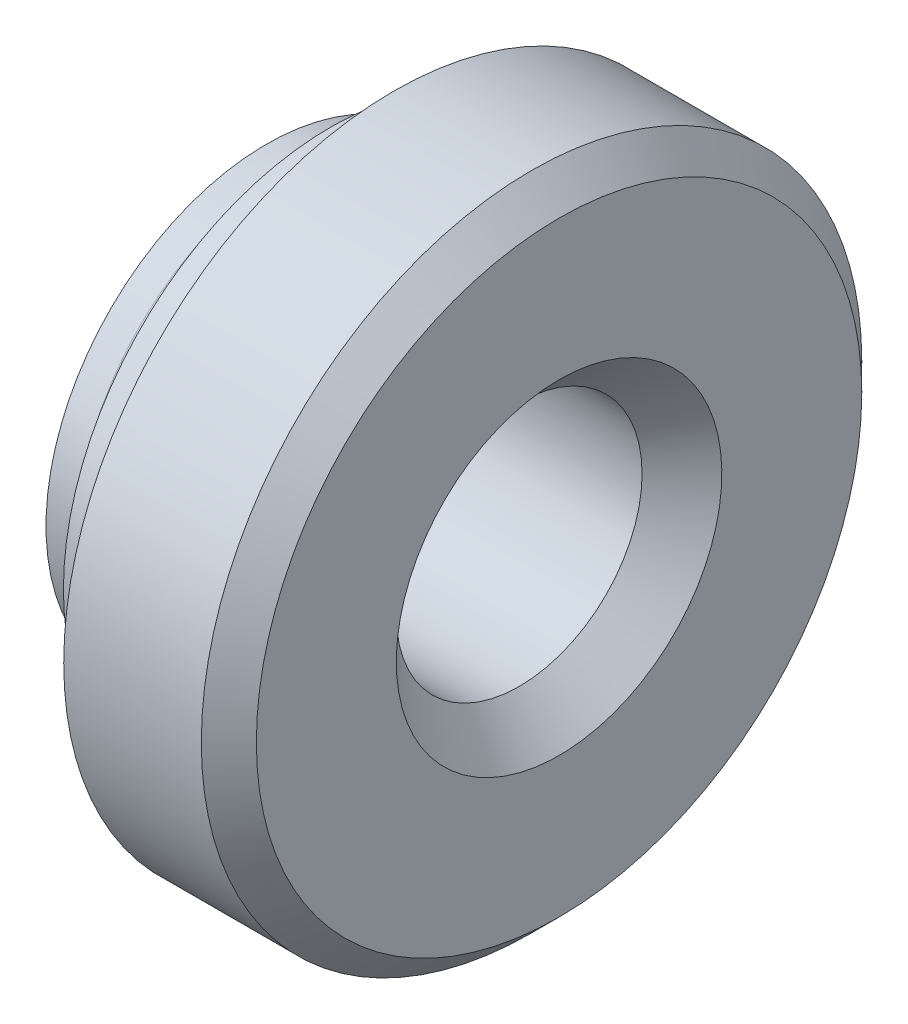
ISO-10303-21;
HEADER;
FILE_DESCRIPTION(('STEP AP214'),'2;1');
FILE_NAME('part.step','',(''),(''),'','','');
FILE_SCHEMA(('AUTOMOTIVE_DESIGN { 1 0 10303 214 1 1 1 1 }'));
ENDSEC;
DATA;
#1=APPLICATION_CONTEXT('core data for automotive mechanical design processes');
#2=APPLICATION_PROTOCOL_DEFINITION('international standard','automotive_design',2000,#1);
#3=PRODUCT_CONTEXT('',#1,'mechanical');
#4=PRODUCT('Part','Part','',(#3));
#5=PRODUCT_RELATED_PRODUCT_CATEGORY('part','',(#4));
#6=PRODUCT_DEFINITION_FORMATION('','',#4);
#7=PRODUCT_DEFINITION_CONTEXT('part definition',#1,'design');
#8=PRODUCT_DEFINITION('design','',#6,#7);
#9=PRODUCT_DEFINITION_SHAPE('','',#8);
#10=(LENGTH_UNIT() NAMED_UNIT(*) SI_UNIT(.MILLI.,.METRE.));
#11=(NAMED_UNIT(*) PLANE_ANGLE_UNIT() SI_UNIT($,.RADIAN.));
#12=(NAMED_UNIT(*) SI_UNIT($,.STERADIAN.) SOLID_ANGLE_UNIT());
#13=UNCERTAINTY_MEASURE_WITH_UNIT(LENGTH_MEASURE(1.E-05),#10,'distance_accuracy_value','');
#14=(GEOMETRIC_REPRESENTATION_CONTEXT(3) GLOBAL_UNCERTAINTY_ASSIGNED_CONTEXT((#13)) GLOBAL_UNIT_ASSIGNED_CONTEXT((#10,
#11,#12)) REPRESENTATION_CONTEXT('',''));
#15=CARTESIAN_POINT('',(0.,0.,0.));
#16=DIRECTION('',(0.,0.,1.));
#17=DIRECTION('',(1.,0.,0.));
#18=AXIS2_PLACEMENT_3D('',#15,#16,#17);
#19=CARTESIAN_POINT('',(0.316523077003695,0.,0.));
#20=DIRECTION('',(-1.,0.,0.));
#21=DIRECTION('',(0.,0.,1.));
#22=AXIS2_PLACEMENT_3D('',#19,#20,#21);
#23=CONICAL_SURFACE('',#22,2.37489999999951,0.106779263745891);
#24=CARTESIAN_POINT('',(0.316523076923077,0.,0.));
#25=DIRECTION('',(1.,0.,0.));
#26=DIRECTION('',(0.,0.,-1.));
#27=AXIS2_PLACEMENT_3D('',#24,#25,#26);
#28=CIRCLE('',#27,2.3749);
#29=CARTESIAN_POINT('',(0.316523076923077,0.,-2.3749));
#30=VERTEX_POINT('',#29);
#31=EDGE_CURVE('E31',#30,#30,#28,.F.);
#32=ORIENTED_EDGE('',*,*,#31,.F.);
#33=EDGE_LOOP('',(#32));
#34=FACE_BOUND('',#33,.T.);
#35=CARTESIAN_POINT('',(0.685799999985192,0.,0.));
#36=DIRECTION('',(-1.,0.,0.));
#37=DIRECTION('',(0.,0.,1.));
#38=AXIS2_PLACEMENT_3D('',#35,#36,#37);
#39=CIRCLE('',#38,2.33531833334309);
#40=CARTESIAN_POINT('',(0.685799999985192,0.,2.33531833334309));
#41=VERTEX_POINT('',#40);
#42=EDGE_CURVE('E19',#41,#41,#39,.F.);
#43=ORIENTED_EDGE('',*,*,#42,.F.);
#44=EDGE_LOOP('',(#43));
#45=FACE_BOUND('',#44,.T.);
#46=ADVANCED_FACE('F15',(#34,#45),#23,.T.);
#47=CARTESIAN_POINT('',(0.158261538461538,0.,0.));
#48=DIRECTION('',(1.,0.,0.));
#49=DIRECTION('',(0.,0.,-1.));
#50=AXIS2_PLACEMENT_3D('',#47,#48,#49);
#51=CYLINDRICAL_SURFACE('',#50,2.3749);
#52=ORIENTED_EDGE('',*,*,#31,.T.);
#53=EDGE_LOOP('',(#52));
#54=FACE_BOUND('',#53,.T.);
#55=CARTESIAN_POINT('',(0.,0.,0.));
#56=DIRECTION('',(1.,0.,0.));
#57=DIRECTION('',(0.,0.,-1.));
#58=AXIS2_PLACEMENT_3D('',#55,#56,#57);
#59=CIRCLE('',#58,2.3749);
#60=CARTESIAN_POINT('',(0.,0.,-2.3749));
#61=VERTEX_POINT('',#60);
#62=EDGE_CURVE('E47',#61,#61,#59,.F.);
#63=ORIENTED_EDGE('',*,*,#62,.F.);
#64=EDGE_LOOP('',(#63));
#65=FACE_BOUND('',#64,.T.);
#66=ADVANCED_FACE('F57',(#54,#65),#51,.T.);
#67=CARTESIAN_POINT('',(0.6858,0.,0.));
#68=DIRECTION('',(-1.,0.,0.));
#69=DIRECTION('',(0.,0.,1.));
#70=AXIS2_PLACEMENT_3D('',#67,#68,#69);
#71=PLANE('',#70);
#72=CARTESIAN_POINT('',(0.6858,0.,0.));
#73=DIRECTION('',(-1.,0.,0.));
#74=DIRECTION('',(0.,0.,1.));
#75=AXIS2_PLACEMENT_3D('',#72,#73,#74);
#76=CIRCLE('',#75,2.873629);
#77=CARTESIAN_POINT('',(0.685799999999999,0.,2.873629));
#78=VERTEX_POINT('',#77);
#79=EDGE_CURVE('E45',#78,#78,#76,.F.);
#80=ORIENTED_EDGE('',*,*,#79,.F.);
#81=EDGE_LOOP('',(#80));
#82=FACE_BOUND('',#81,.T.);
#83=ORIENTED_EDGE('',*,*,#42,.T.);
#84=EDGE_LOOP('',(#83));
#85=FACE_BOUND('',#84,.T.);
#86=ADVANCED_FACE('F68',(#82,#85),#71,.T.);
#87=CARTESIAN_POINT('',(0.,0.,1.18745));
#88=DIRECTION('',(-1.,0.,0.));
#89=DIRECTION('',(0.,0.,1.));
#90=AXIS2_PLACEMENT_3D('',#87,#88,#89);
#91=PLANE('',#90);
#92=ORIENTED_EDGE('',*,*,#62,.T.);
#93=EDGE_LOOP('',(#92));
#94=FACE_BOUND('',#93,.T.);
#95=CARTESIAN_POINT('',(0.,0.,0.));
#96=DIRECTION('',(-1.,0.,0.));
#97=DIRECTION('',(0.,-1.,0.));
#98=AXIS2_PLACEMENT_3D('',#95,#96,#97);
#99=CIRCLE('',#98,1.75260000003163);
#100=CARTESIAN_POINT('',(0.,-1.75260000003163,0.));
#101=VERTEX_POINT('',#100);
#102=EDGE_CURVE('E42',#101,#101,#99,.T.);
#103=ORIENTED_EDGE('',*,*,#102,.F.);
#104=EDGE_LOOP('',(#103));
#105=FACE_BOUND('',#104,.T.);
#106=ADVANCED_FACE('F108',(#94,#105),#91,.T.);
#107=CARTESIAN_POINT('',(1.0287,0.,0.));
#108=DIRECTION('',(-1.,0.,0.));
#109=DIRECTION('',(0.,0.,1.));
#110=AXIS2_PLACEMENT_3D('',#107,#108,#109);
#111=CYLINDRICAL_SURFACE('',#110,2.873629);
#112=CARTESIAN_POINT('',(1.3716,0.,0.));
#113=DIRECTION('',(-1.,0.,0.));
#114=DIRECTION('',(0.,0.,1.));
#115=AXIS2_PLACEMENT_3D('',#112,#113,#114);
#116=CIRCLE('',#115,2.873629);
#117=CARTESIAN_POINT('',(1.3716,0.,2.873629));
#118=VERTEX_POINT('',#117);
#119=EDGE_CURVE('E39',#118,#118,#116,.F.);
#120=ORIENTED_EDGE('',*,*,#119,.F.);
#121=EDGE_LOOP('',(#120));
#122=FACE_BOUND('',#121,.T.);
#123=ORIENTED_EDGE('',*,*,#79,.T.);
#124=EDGE_LOOP('',(#123));
#125=FACE_BOUND('',#124,.T.);
#126=ADVANCED_FACE('F104',(#122,#125),#111,.T.);
#127=CARTESIAN_POINT('',(0.429260000146314,0.,0.));
#128=DIRECTION('',(-1.,0.,0.));
#129=DIRECTION('',(0.,-1.,0.));
#130=AXIS2_PLACEMENT_3D('',#127,#128,#129);
#131=CONICAL_SURFACE('',#130,1.32333999988532,0.785398163397448);
#132=ORIENTED_EDGE('',*,*,#102,.T.);
#133=EDGE_LOOP('',(#132));
#134=FACE_BOUND('',#133,.T.);
#135=CARTESIAN_POINT('',(0.42926,0.,0.));
#136=DIRECTION('',(1.,0.,0.));
#137=DIRECTION('',(0.,0.,1.));
#138=AXIS2_PLACEMENT_3D('',#135,#136,#137);
#139=CIRCLE('',#138,1.32334);
#140=CARTESIAN_POINT('',(0.42926,0.,1.32334));
#141=VERTEX_POINT('',#140);
#142=EDGE_CURVE('E38',#141,#141,#139,.F.);
#143=ORIENTED_EDGE('',*,*,#142,.F.);
#144=EDGE_LOOP('',(#143));
#145=FACE_BOUND('',#144,.T.);
#146=ADVANCED_FACE('F100',(#134,#145),#131,.F.);
#147=CARTESIAN_POINT('',(1.3716,0.,1.778));
#148=DIRECTION('',(-1.,0.,0.));
#149=DIRECTION('',(0.,0.,1.));
#150=AXIS2_PLACEMENT_3D('',#147,#148,#149);
#151=PLANE('',#150);
#152=CARTESIAN_POINT('',(1.3716,0.,0.));
#153=DIRECTION('',(1.,0.,0.));
#154=DIRECTION('',(0.,0.,-1.));
#155=AXIS2_PLACEMENT_3D('',#152,#153,#154);
#156=CIRCLE('',#155,3.556);
#157=CARTESIAN_POINT('',(1.3716,0.,-3.556));
#158=VERTEX_POINT('',#157);
#159=EDGE_CURVE('E34',#158,#158,#156,.T.);
#160=ORIENTED_EDGE('',*,*,#159,.F.);
#161=EDGE_LOOP('',(#160));
#162=FACE_BOUND('',#161,.T.);
#163=ORIENTED_EDGE('',*,*,#119,.T.);
#164=EDGE_LOOP('',(#163));
#165=FACE_BOUND('',#164,.T.);
#166=ADVANCED_FACE('F96',(#162,#165),#151,.T.);
#167=CARTESIAN_POINT('',(2.72034,0.,0.));
#168=DIRECTION('',(-1.,0.,0.));
#169=DIRECTION('',(0.,-1.,0.));
#170=AXIS2_PLACEMENT_3D('',#167,#168,#169);
#171=CYLINDRICAL_SURFACE('',#170,1.32334);
#172=ORIENTED_EDGE('',*,*,#142,.T.);
#173=EDGE_LOOP('',(#172));
#174=FACE_BOUND('',#173,.T.);
#175=CARTESIAN_POINT('',(2.72033999999621,0.,0.));
#176=DIRECTION('',(1.,0.,0.));
#177=DIRECTION('',(0.,0.,1.));
#178=AXIS2_PLACEMENT_3D('',#175,#176,#177);
#179=CIRCLE('',#178,1.32334000005585);
#180=CARTESIAN_POINT('',(2.72033999999621,0.,1.32334000005585));
#181=VERTEX_POINT('',#180);
#182=EDGE_CURVE('E37',#181,#181,#179,.F.);
#183=ORIENTED_EDGE('',*,*,#182,.F.);
#184=EDGE_LOOP('',(#183));
#185=FACE_BOUND('',#184,.T.);
#186=ADVANCED_FACE('F89',(#174,#185),#171,.F.);
#187=CARTESIAN_POINT('',(2.11243333333333,0.,0.));
#188=DIRECTION('',(1.,0.,0.));
#189=DIRECTION('',(0.,0.,-1.));
#190=AXIS2_PLACEMENT_3D('',#187,#188,#189);
#191=CYLINDRICAL_SURFACE('',#190,3.556);
#192=CARTESIAN_POINT('',(2.85326666670471,0.,0.));
#193=DIRECTION('',(-1.,0.,0.));
#194=DIRECTION('',(0.,0.,1.));
#195=AXIS2_PLACEMENT_3D('',#192,#193,#194);
#196=CIRCLE('',#195,3.55599999994638);
#197=CARTESIAN_POINT('',(2.85326666670471,0.,3.55599999994638));
#198=VERTEX_POINT('',#197);
#199=EDGE_CURVE('E28',#198,#198,#196,.F.);
#200=ORIENTED_EDGE('',*,*,#199,.F.);
#201=EDGE_LOOP('',(#200));
#202=FACE_BOUND('',#201,.T.);
#203=ORIENTED_EDGE('',*,*,#159,.T.);
#204=EDGE_LOOP('',(#203));
#205=FACE_BOUND('',#204,.T.);
#206=ADVANCED_FACE('F82',(#202,#205),#191,.T.);
#207=CARTESIAN_POINT('',(2.72033999982568,0.,0.));
#208=DIRECTION('',(1.,0.,0.));
#209=DIRECTION('',(0.,1.,0.));
#210=AXIS2_PLACEMENT_3D('',#207,#208,#209);
#211=CONICAL_SURFACE('',#210,1.32333999988532,0.785398163463659);
#212=ORIENTED_EDGE('',*,*,#182,.T.);
#213=EDGE_LOOP('',(#212));
#214=FACE_BOUND('',#213,.T.);
#215=CARTESIAN_POINT('',(3.14959999980147,0.,0.));
#216=DIRECTION('',(1.,0.,0.));
#217=DIRECTION('',(0.,1.,0.));
#218=AXIS2_PLACEMENT_3D('',#215,#216,#217);
#219=CIRCLE('',#218,1.75259999991795);
#220=CARTESIAN_POINT('',(3.14959999980147,1.75259999991795,0.));
#221=VERTEX_POINT('',#220);
#222=EDGE_CURVE('E23',#221,#221,#219,.F.);
#223=ORIENTED_EDGE('',*,*,#222,.F.);
#224=EDGE_LOOP('',(#223));
#225=FACE_BOUND('',#224,.T.);
#226=ADVANCED_FACE('F76',(#214,#225),#211,.F.);
#227=CARTESIAN_POINT('',(2.85326666676156,0.,0.));
#228=DIRECTION('',(-1.,0.,0.));
#229=DIRECTION('',(0.,0.,1.));
#230=AXIS2_PLACEMENT_3D('',#227,#228,#229);
#231=CONICAL_SURFACE('',#230,3.55599999988954,0.785398163397449);
#232=CARTESIAN_POINT('',(3.14960000002884,0.,0.));
#233=DIRECTION('',(-1.,0.,0.));
#234=DIRECTION('',(0.,0.,1.));
#235=AXIS2_PLACEMENT_3D('',#232,#233,#234);
#236=CIRCLE('',#235,3.25966666662225);
#237=CARTESIAN_POINT('',(3.14960000002884,0.,3.25966666662225));
#238=VERTEX_POINT('',#237);
#239=EDGE_CURVE('E10',#238,#238,#236,.F.);
#240=ORIENTED_EDGE('',*,*,#239,.F.);
#241=EDGE_LOOP('',(#240));
#242=FACE_BOUND('',#241,.T.);
#243=ORIENTED_EDGE('',*,*,#199,.T.);
#244=EDGE_LOOP('',(#243));
#245=FACE_BOUND('',#244,.T.);
#246=ADVANCED_FACE('F71',(#242,#245),#231,.T.);
#247=CARTESIAN_POINT('',(3.1496,0.,1.62983333333333));
#248=DIRECTION('',(1.,0.,0.));
#249=DIRECTION('',(0.,1.,0.));
#250=AXIS2_PLACEMENT_3D('',#247,#248,#249);
#251=PLANE('',#250);
#252=ORIENTED_EDGE('',*,*,#239,.T.);
#253=EDGE_LOOP('',(#252));
#254=FACE_BOUND('',#253,.T.);
#255=ORIENTED_EDGE('',*,*,#222,.T.);
#256=EDGE_LOOP('',(#255));
#257=FACE_BOUND('',#256,.T.);
#258=ADVANCED_FACE('F17',(#254,#257),#251,.T.);
#259=CLOSED_SHELL('',(#46,#66,#86,#106,#126,#146,#166,#186,#206,#226,#246,#258));
#260=MANIFOLD_SOLID_BREP('B1',#259);
#261=ADVANCED_BREP_SHAPE_REPRESENTATION('',(#18,#260),#14);
#262=SHAPE_DEFINITION_REPRESENTATION(#9,#261);
ENDSEC;
END-ISO-10303-21;
